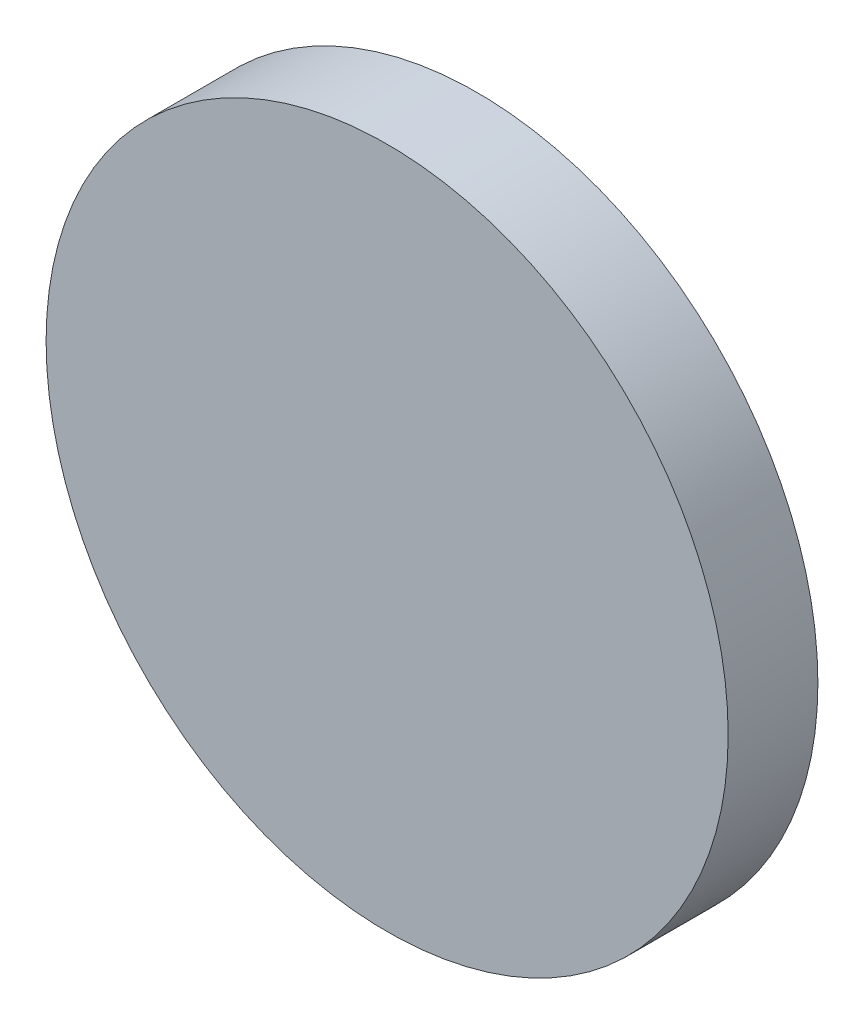
ISO-10303-21;
HEADER;
FILE_DESCRIPTION(('STEP AP214'),'2;1');
FILE_NAME('part.step','',(''),(''),'','','');
FILE_SCHEMA(('AUTOMOTIVE_DESIGN { 1 0 10303 214 1 1 1 1 }'));
ENDSEC;
DATA;
#1=APPLICATION_CONTEXT('core data for automotive mechanical design processes');
#2=APPLICATION_PROTOCOL_DEFINITION('international standard','automotive_design',2000,#1);
#3=PRODUCT_CONTEXT('',#1,'mechanical');
#4=PRODUCT('Part','Part','',(#3));
#5=PRODUCT_RELATED_PRODUCT_CATEGORY('part','',(#4));
#6=PRODUCT_DEFINITION_FORMATION('','',#4);
#7=PRODUCT_DEFINITION_CONTEXT('part definition',#1,'design');
#8=PRODUCT_DEFINITION('design','',#6,#7);
#9=PRODUCT_DEFINITION_SHAPE('','',#8);
#10=(LENGTH_UNIT() NAMED_UNIT(*) SI_UNIT(.MILLI.,.METRE.));
#11=(NAMED_UNIT(*) PLANE_ANGLE_UNIT() SI_UNIT($,.RADIAN.));
#12=(NAMED_UNIT(*) SI_UNIT($,.STERADIAN.) SOLID_ANGLE_UNIT());
#13=UNCERTAINTY_MEASURE_WITH_UNIT(LENGTH_MEASURE(1.E-05),#10,'distance_accuracy_value','');
#14=(GEOMETRIC_REPRESENTATION_CONTEXT(3) GLOBAL_UNCERTAINTY_ASSIGNED_CONTEXT((#13)) GLOBAL_UNIT_ASSIGNED_CONTEXT((#10,
#11,#12)) REPRESENTATION_CONTEXT('',''));
#15=CARTESIAN_POINT('',(0.,0.,0.));
#16=DIRECTION('',(0.,0.,1.));
#17=DIRECTION('',(1.,0.,0.));
#18=AXIS2_PLACEMENT_3D('',#15,#16,#17);
#19=CARTESIAN_POINT('',(-81.1281234244916,39.6078302042042,2.5));
#20=DIRECTION('',(0.,0.,-1.));
#21=DIRECTION('',(-1.,0.,0.));
#22=AXIS2_PLACEMENT_3D('',#19,#20,#21);
#23=CYLINDRICAL_SURFACE('',#22,9.5);
#24=CARTESIAN_POINT('',(-81.1281234244916,39.6078302042042,2.5));
#25=DIRECTION('',(0.,0.,1.));
#26=DIRECTION('',(1.,0.,0.));
#27=AXIS2_PLACEMENT_3D('',#24,#25,#26);
#28=CIRCLE('',#27,9.5);
#29=CARTESIAN_POINT('',(-71.6281234244916,39.6078302042042,2.5));
#30=VERTEX_POINT('',#29);
#31=EDGE_CURVE('E10',#30,#30,#28,.T.);
#32=ORIENTED_EDGE('',*,*,#31,.F.);
#33=EDGE_LOOP('',(#32));
#34=FACE_BOUND('',#33,.T.);
#35=CARTESIAN_POINT('',(-81.1281234244916,39.6078302042042,0.));
#36=DIRECTION('',(0.,0.,1.));
#37=DIRECTION('',(1.,0.,0.));
#38=AXIS2_PLACEMENT_3D('',#35,#36,#37);
#39=CIRCLE('',#38,9.5);
#40=CARTESIAN_POINT('',(-71.6281234244916,39.6078302042042,0.));
#41=VERTEX_POINT('',#40);
#42=EDGE_CURVE('E33',#41,#41,#39,.T.);
#43=ORIENTED_EDGE('',*,*,#42,.T.);
#44=EDGE_LOOP('',(#43));
#45=FACE_BOUND('',#44,.T.);
#46=ADVANCED_FACE('F30',(#34,#45),#23,.T.);
#47=CARTESIAN_POINT('',(-81.1281234244916,39.6078302042042,2.5));
#48=DIRECTION('',(0.,0.,1.));
#49=DIRECTION('',(1.,0.,0.));
#50=AXIS2_PLACEMENT_3D('',#47,#48,#49);
#51=PLANE('',#50);
#52=ORIENTED_EDGE('',*,*,#31,.T.);
#53=EDGE_LOOP('',(#52));
#54=FACE_BOUND('',#53,.T.);
#55=ADVANCED_FACE('F45',(#54),#51,.T.);
#56=CARTESIAN_POINT('',(-81.1281234244916,39.6078302042042,0.));
#57=DIRECTION('',(0.,0.,1.));
#58=DIRECTION('',(1.,0.,0.));
#59=AXIS2_PLACEMENT_3D('',#56,#57,#58);
#60=PLANE('',#59);
#61=ORIENTED_EDGE('',*,*,#42,.F.);
#62=EDGE_LOOP('',(#61));
#63=FACE_BOUND('',#62,.T.);
#64=ADVANCED_FACE('F43',(#63),#60,.F.);
#65=CLOSED_SHELL('',(#46,#55,#64));
#66=MANIFOLD_SOLID_BREP('B2',#65);
#67=ADVANCED_BREP_SHAPE_REPRESENTATION('',(#18,#66),#14);
#68=SHAPE_DEFINITION_REPRESENTATION(#9,#67);
ENDSEC;
END-ISO-10303-21;
